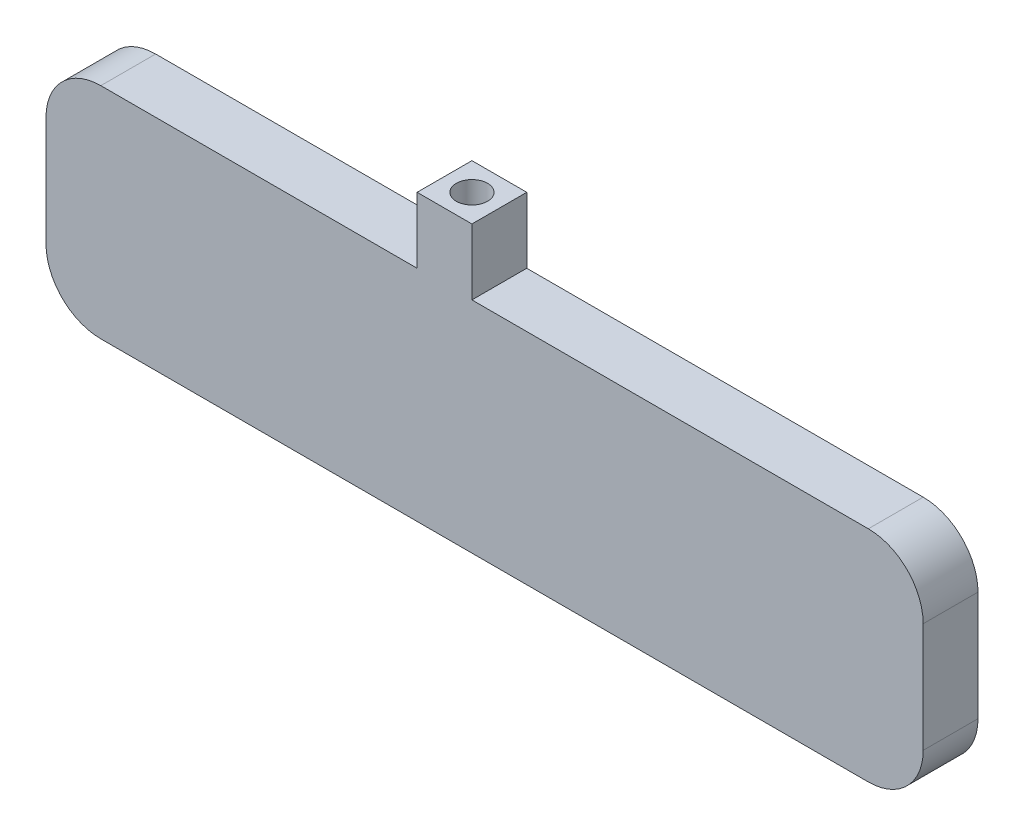
ISO-10303-21;
HEADER;
FILE_DESCRIPTION(('STEP AP214'),'2;1');
FILE_NAME('part.step','',(''),(''),'','','');
FILE_SCHEMA(('AUTOMOTIVE_DESIGN { 1 0 10303 214 1 1 1 1 }'));
ENDSEC;
DATA;
#1=APPLICATION_CONTEXT('core data for automotive mechanical design processes');
#2=APPLICATION_PROTOCOL_DEFINITION('international standard','automotive_design',2000,#1);
#3=PRODUCT_CONTEXT('',#1,'mechanical');
#4=PRODUCT('Part','Part','',(#3));
#5=PRODUCT_RELATED_PRODUCT_CATEGORY('part','',(#4));
#6=PRODUCT_DEFINITION_FORMATION('','',#4);
#7=PRODUCT_DEFINITION_CONTEXT('part definition',#1,'design');
#8=PRODUCT_DEFINITION('design','',#6,#7);
#9=PRODUCT_DEFINITION_SHAPE('','',#8);
#10=(LENGTH_UNIT() NAMED_UNIT(*) SI_UNIT(.MILLI.,.METRE.));
#11=(NAMED_UNIT(*) PLANE_ANGLE_UNIT() SI_UNIT($,.RADIAN.));
#12=(NAMED_UNIT(*) SI_UNIT($,.STERADIAN.) SOLID_ANGLE_UNIT());
#13=UNCERTAINTY_MEASURE_WITH_UNIT(LENGTH_MEASURE(1.E-05),#10,'distance_accuracy_value','');
#14=(GEOMETRIC_REPRESENTATION_CONTEXT(3) GLOBAL_UNCERTAINTY_ASSIGNED_CONTEXT((#13)) GLOBAL_UNIT_ASSIGNED_CONTEXT((#10,
#11,#12)) REPRESENTATION_CONTEXT('',''));
#15=CARTESIAN_POINT('',(0.,0.,0.));
#16=DIRECTION('',(0.,0.,1.));
#17=DIRECTION('',(1.,0.,0.));
#18=AXIS2_PLACEMENT_3D('',#15,#16,#17);
#19=CARTESIAN_POINT('',(-40.,10.,5.));
#20=DIRECTION('',(0.,-1.,0.));
#21=DIRECTION('',(0.,0.,-1.));
#22=AXIS2_PLACEMENT_3D('',#19,#20,#21);
#23=PLANE('',#22);
#24=DIRECTION('',(0.,0.,1.));
#25=VECTOR('',#24,1.);
#26=CARTESIAN_POINT('',(-6.15395389252171,10.,0.));
#27=LINE('',#26,#25);
#28=CARTESIAN_POINT('',(-6.15395389252171,10.,0.));
#29=VERTEX_POINT('',#28);
#30=CARTESIAN_POINT('',(-6.15395389252171,10.,5.));
#31=VERTEX_POINT('',#30);
#32=EDGE_CURVE('E55',#29,#31,#27,.T.);
#33=ORIENTED_EDGE('',*,*,#32,.F.);
#34=DIRECTION('',(-1.,0.,0.));
#35=VECTOR('',#34,1.);
#36=CARTESIAN_POINT('',(-40.,10.,0.));
#37=LINE('',#36,#35);
#38=CARTESIAN_POINT('',(-35.,10.,0.));
#39=VERTEX_POINT('',#38);
#40=EDGE_CURVE('E307',#29,#39,#37,.T.);
#41=ORIENTED_EDGE('',*,*,#40,.T.);
#42=DIRECTION('',(0.,0.,-1.));
#43=VECTOR('',#42,1.);
#44=CARTESIAN_POINT('',(-35.,10.,5.));
#45=LINE('',#44,#43);
#46=CARTESIAN_POINT('',(-35.,10.,5.));
#47=VERTEX_POINT('',#46);
#48=EDGE_CURVE('E357',#39,#47,#45,.F.);
#49=ORIENTED_EDGE('',*,*,#48,.T.);
#50=DIRECTION('',(-1.,0.,0.));
#51=VECTOR('',#50,1.);
#52=CARTESIAN_POINT('',(-40.,10.,5.));
#53=LINE('',#52,#51);
#54=EDGE_CURVE('E291',#31,#47,#53,.T.);
#55=ORIENTED_EDGE('',*,*,#54,.F.);
#56=EDGE_LOOP('',(#33,#41,#49,#55));
#57=FACE_BOUND('',#56,.T.);
#58=ADVANCED_FACE('F39',(#57),#23,.F.);
#59=DIRECTION('',(0.,0.,-1.));
#60=VECTOR('',#59,1.);
#61=CARTESIAN_POINT('',(-1.15395389252171,10.,0.));
#62=LINE('',#61,#60);
#63=CARTESIAN_POINT('',(-1.15395389252171,10.,5.));
#64=VERTEX_POINT('',#63);
#65=CARTESIAN_POINT('',(-1.15395389252171,10.,0.));
#66=VERTEX_POINT('',#65);
#67=EDGE_CURVE('E198',#64,#66,#62,.T.);
#68=ORIENTED_EDGE('',*,*,#67,.F.);
#69=CARTESIAN_POINT('',(35.,10.,5.));
#70=VERTEX_POINT('',#69);
#71=EDGE_CURVE('E293',#70,#64,#53,.T.);
#72=ORIENTED_EDGE('',*,*,#71,.F.);
#73=DIRECTION('',(0.,0.,-1.));
#74=VECTOR('',#73,1.);
#75=CARTESIAN_POINT('',(35.,10.,5.));
#76=LINE('',#75,#74);
#77=CARTESIAN_POINT('',(35.,10.,0.));
#78=VERTEX_POINT('',#77);
#79=EDGE_CURVE('E361',#70,#78,#76,.T.);
#80=ORIENTED_EDGE('',*,*,#79,.T.);
#81=EDGE_CURVE('E308',#78,#66,#37,.T.);
#82=ORIENTED_EDGE('',*,*,#81,.T.);
#83=EDGE_LOOP('',(#68,#72,#80,#82));
#84=FACE_BOUND('',#83,.T.);
#85=ADVANCED_FACE('F406',(#84),#23,.F.);
#86=CARTESIAN_POINT('',(0.,0.,0.));
#87=DIRECTION('',(0.,0.,1.));
#88=DIRECTION('',(1.,0.,0.));
#89=AXIS2_PLACEMENT_3D('',#86,#87,#88);
#90=PLANE('',#89);
#91=DIRECTION('',(0.,1.,0.));
#92=VECTOR('',#91,1.);
#93=CARTESIAN_POINT('',(40.,10.,0.));
#94=LINE('',#93,#92);
#95=CARTESIAN_POINT('',(40.,-5.,0.));
#96=VERTEX_POINT('',#95);
#97=CARTESIAN_POINT('',(40.,5.,0.));
#98=VERTEX_POINT('',#97);
#99=EDGE_CURVE('E261',#96,#98,#94,.T.);
#100=ORIENTED_EDGE('',*,*,#99,.F.);
#101=CARTESIAN_POINT('',(35.,-5.,0.));
#102=DIRECTION('',(0.,0.,1.));
#103=DIRECTION('',(1.,0.,0.));
#104=AXIS2_PLACEMENT_3D('',#101,#102,#103);
#105=CIRCLE('',#104,5.);
#106=CARTESIAN_POINT('',(35.,-10.,0.));
#107=VERTEX_POINT('',#106);
#108=EDGE_CURVE('E335',#96,#107,#105,.F.);
#109=ORIENTED_EDGE('',*,*,#108,.T.);
#110=DIRECTION('',(1.,0.,0.));
#111=VECTOR('',#110,1.);
#112=CARTESIAN_POINT('',(-40.,-10.,0.));
#113=LINE('',#112,#111);
#114=CARTESIAN_POINT('',(-35.,-10.,0.));
#115=VERTEX_POINT('',#114);
#116=EDGE_CURVE('E292',#115,#107,#113,.T.);
#117=ORIENTED_EDGE('',*,*,#116,.F.);
#118=CARTESIAN_POINT('',(-35.,-5.,0.));
#119=DIRECTION('',(0.,0.,1.));
#120=DIRECTION('',(1.,0.,0.));
#121=AXIS2_PLACEMENT_3D('',#118,#119,#120);
#122=CIRCLE('',#121,5.);
#123=CARTESIAN_POINT('',(-40.,-5.,0.));
#124=VERTEX_POINT('',#123);
#125=EDGE_CURVE('E329',#115,#124,#122,.F.);
#126=ORIENTED_EDGE('',*,*,#125,.T.);
#127=DIRECTION('',(0.,-1.,0.));
#128=VECTOR('',#127,1.);
#129=CARTESIAN_POINT('',(-40.,10.,0.));
#130=LINE('',#129,#128);
#131=CARTESIAN_POINT('',(-40.,5.,0.));
#132=VERTEX_POINT('',#131);
#133=EDGE_CURVE('E312',#132,#124,#130,.T.);
#134=ORIENTED_EDGE('',*,*,#133,.F.);
#135=CARTESIAN_POINT('',(-35.,5.,0.));
#136=DIRECTION('',(0.,0.,1.));
#137=DIRECTION('',(1.,0.,0.));
#138=AXIS2_PLACEMENT_3D('',#135,#136,#137);
#139=CIRCLE('',#138,5.);
#140=EDGE_CURVE('E325',#132,#39,#139,.F.);
#141=ORIENTED_EDGE('',*,*,#140,.T.);
#142=ORIENTED_EDGE('',*,*,#40,.F.);
#143=DIRECTION('',(0.,-1.,0.));
#144=VECTOR('',#143,1.);
#145=CARTESIAN_POINT('',(-6.15395389252171,16.,0.));
#146=LINE('',#145,#144);
#147=CARTESIAN_POINT('',(-6.15395389252171,16.,0.));
#148=VERTEX_POINT('',#147);
#149=EDGE_CURVE('E416',#148,#29,#146,.T.);
#150=ORIENTED_EDGE('',*,*,#149,.F.);
#151=DIRECTION('',(-1.,0.,0.));
#152=VECTOR('',#151,1.);
#153=CARTESIAN_POINT('',(-6.15395389252171,16.,0.));
#154=LINE('',#153,#152);
#155=CARTESIAN_POINT('',(-1.15395389252171,16.,0.));
#156=VERTEX_POINT('',#155);
#157=EDGE_CURVE('E195',#156,#148,#154,.T.);
#158=ORIENTED_EDGE('',*,*,#157,.F.);
#159=DIRECTION('',(0.,-1.,0.));
#160=VECTOR('',#159,1.);
#161=CARTESIAN_POINT('',(-1.15395389252171,16.,0.));
#162=LINE('',#161,#160);
#163=EDGE_CURVE('E208',#156,#66,#162,.T.);
#164=ORIENTED_EDGE('',*,*,#163,.T.);
#165=ORIENTED_EDGE('',*,*,#81,.F.);
#166=CARTESIAN_POINT('',(35.,5.,0.));
#167=DIRECTION('',(0.,0.,1.));
#168=DIRECTION('',(1.,0.,0.));
#169=AXIS2_PLACEMENT_3D('',#166,#167,#168);
#170=CIRCLE('',#169,5.);
#171=EDGE_CURVE('E332',#78,#98,#170,.F.);
#172=ORIENTED_EDGE('',*,*,#171,.T.);
#173=EDGE_LOOP('',(#100,#109,#117,#126,#134,#141,#142,#150,#158,#164,#165,#172));
#174=FACE_BOUND('',#173,.T.);
#175=CARTESIAN_POINT('',(35.,-5.,0.));
#176=DIRECTION('',(0.,0.,1.));
#177=DIRECTION('',(1.,0.,0.));
#178=AXIS2_PLACEMENT_3D('',#175,#176,#177);
#179=CIRCLE('',#178,3.);
#180=CARTESIAN_POINT('',(38.,-5.,0.));
#181=VERTEX_POINT('',#180);
#182=CARTESIAN_POINT('',(35.,-8.,0.));
#183=VERTEX_POINT('',#182);
#184=EDGE_CURVE('E265',#181,#183,#179,.F.);
#185=ORIENTED_EDGE('',*,*,#184,.F.);
#186=DIRECTION('',(0.,1.,0.));
#187=VECTOR('',#186,1.);
#188=CARTESIAN_POINT('',(38.,10.,0.));
#189=LINE('',#188,#187);
#190=CARTESIAN_POINT('',(38.,5.,0.));
#191=VERTEX_POINT('',#190);
#192=EDGE_CURVE('E202',#181,#191,#189,.T.);
#193=ORIENTED_EDGE('',*,*,#192,.T.);
#194=CARTESIAN_POINT('',(35.,5.,0.));
#195=DIRECTION('',(0.,0.,1.));
#196=DIRECTION('',(1.,0.,0.));
#197=AXIS2_PLACEMENT_3D('',#194,#195,#196);
#198=CIRCLE('',#197,3.);
#199=CARTESIAN_POINT('',(35.,8.,0.));
#200=VERTEX_POINT('',#199);
#201=EDGE_CURVE('E270',#200,#191,#198,.F.);
#202=ORIENTED_EDGE('',*,*,#201,.F.);
#203=DIRECTION('',(-1.,0.,0.));
#204=VECTOR('',#203,1.);
#205=CARTESIAN_POINT('',(-40.,8.,0.));
#206=LINE('',#205,#204);
#207=CARTESIAN_POINT('',(-35.,8.,0.));
#208=VERTEX_POINT('',#207);
#209=EDGE_CURVE('E63',#200,#208,#206,.T.);
#210=ORIENTED_EDGE('',*,*,#209,.T.);
#211=CARTESIAN_POINT('',(-35.,5.,0.));
#212=DIRECTION('',(0.,0.,1.));
#213=DIRECTION('',(1.,0.,0.));
#214=AXIS2_PLACEMENT_3D('',#211,#212,#213);
#215=CIRCLE('',#214,3.);
#216=CARTESIAN_POINT('',(-38.,5.,0.));
#217=VERTEX_POINT('',#216);
#218=EDGE_CURVE('E221',#217,#208,#215,.F.);
#219=ORIENTED_EDGE('',*,*,#218,.F.);
#220=DIRECTION('',(0.,-1.,0.));
#221=VECTOR('',#220,1.);
#222=CARTESIAN_POINT('',(-38.,10.,0.));
#223=LINE('',#222,#221);
#224=CARTESIAN_POINT('',(-38.,-5.,0.));
#225=VERTEX_POINT('',#224);
#226=EDGE_CURVE('E274',#217,#225,#223,.T.);
#227=ORIENTED_EDGE('',*,*,#226,.T.);
#228=CARTESIAN_POINT('',(-35.,-5.,0.));
#229=DIRECTION('',(0.,0.,1.));
#230=DIRECTION('',(1.,0.,0.));
#231=AXIS2_PLACEMENT_3D('',#228,#229,#230);
#232=CIRCLE('',#231,3.);
#233=CARTESIAN_POINT('',(-35.,-8.,0.));
#234=VERTEX_POINT('',#233);
#235=EDGE_CURVE('E275',#234,#225,#232,.F.);
#236=ORIENTED_EDGE('',*,*,#235,.F.);
#237=DIRECTION('',(1.,0.,0.));
#238=VECTOR('',#237,1.);
#239=CARTESIAN_POINT('',(-40.,-8.,0.));
#240=LINE('',#239,#238);
#241=EDGE_CURVE('E217',#234,#183,#240,.T.);
#242=ORIENTED_EDGE('',*,*,#241,.T.);
#243=EDGE_LOOP('',(#185,#193,#202,#210,#219,#227,#236,#242));
#244=FACE_BOUND('',#243,.T.);
#245=ADVANCED_FACE('F376',(#174,#244),#90,.F.);
#246=CARTESIAN_POINT('',(40.,10.,5.));
#247=DIRECTION('',(-1.,0.,0.));
#248=DIRECTION('',(0.,0.,1.));
#249=AXIS2_PLACEMENT_3D('',#246,#247,#248);
#250=PLANE('',#249);
#251=DIRECTION('',(0.,1.,0.));
#252=VECTOR('',#251,1.);
#253=CARTESIAN_POINT('',(40.,10.,5.));
#254=LINE('',#253,#252);
#255=CARTESIAN_POINT('',(40.,-5.,5.));
#256=VERTEX_POINT('',#255);
#257=CARTESIAN_POINT('',(40.,5.,5.));
#258=VERTEX_POINT('',#257);
#259=EDGE_CURVE('E287',#256,#258,#254,.T.);
#260=ORIENTED_EDGE('',*,*,#259,.F.);
#261=DIRECTION('',(0.,0.,-1.));
#262=VECTOR('',#261,1.);
#263=CARTESIAN_POINT('',(40.,-5.,5.));
#264=LINE('',#263,#262);
#265=EDGE_CURVE('E321',#256,#96,#264,.T.);
#266=ORIENTED_EDGE('',*,*,#265,.T.);
#267=ORIENTED_EDGE('',*,*,#99,.T.);
#268=DIRECTION('',(0.,0.,-1.));
#269=VECTOR('',#268,1.);
#270=CARTESIAN_POINT('',(40.,5.,5.));
#271=LINE('',#270,#269);
#272=EDGE_CURVE('E303',#98,#258,#271,.F.);
#273=ORIENTED_EDGE('',*,*,#272,.T.);
#274=EDGE_LOOP('',(#260,#266,#267,#273));
#275=FACE_BOUND('',#274,.T.);
#276=ADVANCED_FACE('F395',(#275),#250,.F.);
#277=CARTESIAN_POINT('',(-40.,10.,5.));
#278=DIRECTION('',(1.,0.,0.));
#279=DIRECTION('',(0.,0.,-1.));
#280=AXIS2_PLACEMENT_3D('',#277,#278,#279);
#281=PLANE('',#280);
#282=ORIENTED_EDGE('',*,*,#133,.T.);
#283=DIRECTION('',(0.,0.,-1.));
#284=VECTOR('',#283,1.);
#285=CARTESIAN_POINT('',(-40.,-5.,5.));
#286=LINE('',#285,#284);
#287=CARTESIAN_POINT('',(-40.,-5.,5.));
#288=VERTEX_POINT('',#287);
#289=EDGE_CURVE('E11',#124,#288,#286,.F.);
#290=ORIENTED_EDGE('',*,*,#289,.T.);
#291=DIRECTION('',(0.,-1.,0.));
#292=VECTOR('',#291,1.);
#293=CARTESIAN_POINT('',(-40.,10.,5.));
#294=LINE('',#293,#292);
#295=CARTESIAN_POINT('',(-40.,5.,5.));
#296=VERTEX_POINT('',#295);
#297=EDGE_CURVE('E296',#296,#288,#294,.T.);
#298=ORIENTED_EDGE('',*,*,#297,.F.);
#299=DIRECTION('',(0.,0.,-1.));
#300=VECTOR('',#299,1.);
#301=CARTESIAN_POINT('',(-40.,5.,5.));
#302=LINE('',#301,#300);
#303=EDGE_CURVE('E48',#296,#132,#302,.T.);
#304=ORIENTED_EDGE('',*,*,#303,.T.);
#305=EDGE_LOOP('',(#282,#290,#298,#304));
#306=FACE_BOUND('',#305,.T.);
#307=ADVANCED_FACE('F370',(#306),#281,.F.);
#308=CARTESIAN_POINT('',(-40.,-10.,5.));
#309=DIRECTION('',(0.,1.,0.));
#310=DIRECTION('',(0.,0.,1.));
#311=AXIS2_PLACEMENT_3D('',#308,#309,#310);
#312=PLANE('',#311);
#313=ORIENTED_EDGE('',*,*,#116,.T.);
#314=DIRECTION('',(0.,0.,-1.));
#315=VECTOR('',#314,1.);
#316=CARTESIAN_POINT('',(35.,-10.,5.));
#317=LINE('',#316,#315);
#318=CARTESIAN_POINT('',(35.,-10.,5.));
#319=VERTEX_POINT('',#318);
#320=EDGE_CURVE('E342',#107,#319,#317,.F.);
#321=ORIENTED_EDGE('',*,*,#320,.T.);
#322=DIRECTION('',(1.,0.,0.));
#323=VECTOR('',#322,1.);
#324=CARTESIAN_POINT('',(-40.,-10.,5.));
#325=LINE('',#324,#323);
#326=CARTESIAN_POINT('',(-35.,-10.,5.));
#327=VERTEX_POINT('',#326);
#328=EDGE_CURVE('E300',#327,#319,#325,.T.);
#329=ORIENTED_EDGE('',*,*,#328,.F.);
#330=DIRECTION('',(0.,0.,-1.));
#331=VECTOR('',#330,1.);
#332=CARTESIAN_POINT('',(-35.,-10.,5.));
#333=LINE('',#332,#331);
#334=EDGE_CURVE('E338',#327,#115,#333,.T.);
#335=ORIENTED_EDGE('',*,*,#334,.T.);
#336=EDGE_LOOP('',(#313,#321,#329,#335));
#337=FACE_BOUND('',#336,.T.);
#338=ADVANCED_FACE('F387',(#337),#312,.F.);
#339=CARTESIAN_POINT('',(0.,0.,5.));
#340=DIRECTION('',(0.,0.,1.));
#341=DIRECTION('',(1.,0.,0.));
#342=AXIS2_PLACEMENT_3D('',#339,#340,#341);
#343=PLANE('',#342);
#344=ORIENTED_EDGE('',*,*,#328,.T.);
#345=CARTESIAN_POINT('',(35.,-5.,5.));
#346=DIRECTION('',(0.,0.,1.));
#347=DIRECTION('',(1.,0.,0.));
#348=AXIS2_PLACEMENT_3D('',#345,#346,#347);
#349=CIRCLE('',#348,5.);
#350=EDGE_CURVE('E354',#319,#256,#349,.T.);
#351=ORIENTED_EDGE('',*,*,#350,.T.);
#352=ORIENTED_EDGE('',*,*,#259,.T.);
#353=CARTESIAN_POINT('',(35.,5.,5.));
#354=DIRECTION('',(0.,0.,1.));
#355=DIRECTION('',(1.,0.,0.));
#356=AXIS2_PLACEMENT_3D('',#353,#354,#355);
#357=CIRCLE('',#356,5.);
#358=EDGE_CURVE('E351',#258,#70,#357,.T.);
#359=ORIENTED_EDGE('',*,*,#358,.T.);
#360=ORIENTED_EDGE('',*,*,#71,.T.);
#361=DIRECTION('',(0.,-1.,0.));
#362=VECTOR('',#361,1.);
#363=CARTESIAN_POINT('',(-1.15395389252171,16.,5.));
#364=LINE('',#363,#362);
#365=CARTESIAN_POINT('',(-1.15395389252171,16.,5.));
#366=VERTEX_POINT('',#365);
#367=EDGE_CURVE('E185',#366,#64,#364,.T.);
#368=ORIENTED_EDGE('',*,*,#367,.F.);
#369=DIRECTION('',(1.,0.,0.));
#370=VECTOR('',#369,1.);
#371=CARTESIAN_POINT('',(-6.15395389252171,16.,5.));
#372=LINE('',#371,#370);
#373=CARTESIAN_POINT('',(-6.15395389252171,16.,5.));
#374=VERTEX_POINT('',#373);
#375=EDGE_CURVE('E178',#374,#366,#372,.T.);
#376=ORIENTED_EDGE('',*,*,#375,.F.);
#377=DIRECTION('',(0.,-1.,0.));
#378=VECTOR('',#377,1.);
#379=CARTESIAN_POINT('',(-6.15395389252171,16.,5.));
#380=LINE('',#379,#378);
#381=EDGE_CURVE('E182',#374,#31,#380,.T.);
#382=ORIENTED_EDGE('',*,*,#381,.T.);
#383=ORIENTED_EDGE('',*,*,#54,.T.);
#384=CARTESIAN_POINT('',(-35.,5.,5.));
#385=DIRECTION('',(0.,0.,1.));
#386=DIRECTION('',(1.,0.,0.));
#387=AXIS2_PLACEMENT_3D('',#384,#385,#386);
#388=CIRCLE('',#387,5.);
#389=EDGE_CURVE('E345',#47,#296,#388,.T.);
#390=ORIENTED_EDGE('',*,*,#389,.T.);
#391=ORIENTED_EDGE('',*,*,#297,.T.);
#392=CARTESIAN_POINT('',(-35.,-5.,5.));
#393=DIRECTION('',(0.,0.,1.));
#394=DIRECTION('',(1.,0.,0.));
#395=AXIS2_PLACEMENT_3D('',#392,#393,#394);
#396=CIRCLE('',#395,5.);
#397=EDGE_CURVE('E348',#288,#327,#396,.T.);
#398=ORIENTED_EDGE('',*,*,#397,.T.);
#399=EDGE_LOOP('',(#344,#351,#352,#359,#360,#368,#376,#382,#383,#390,#391,#398));
#400=FACE_BOUND('',#399,.T.);
#401=ADVANCED_FACE('F181',(#400),#343,.T.);
#402=CARTESIAN_POINT('',(35.,-5.,5.));
#403=DIRECTION('',(0.,0.,-1.));
#404=DIRECTION('',(-1.,0.,0.));
#405=AXIS2_PLACEMENT_3D('',#402,#403,#404);
#406=CYLINDRICAL_SURFACE('',#405,5.);
#407=ORIENTED_EDGE('',*,*,#350,.F.);
#408=ORIENTED_EDGE('',*,*,#320,.F.);
#409=ORIENTED_EDGE('',*,*,#108,.F.);
#410=ORIENTED_EDGE('',*,*,#265,.F.);
#411=EDGE_LOOP('',(#407,#408,#409,#410));
#412=FACE_BOUND('',#411,.T.);
#413=ADVANCED_FACE('F393',(#412),#406,.T.);
#414=CARTESIAN_POINT('',(35.,5.,5.));
#415=DIRECTION('',(0.,0.,-1.));
#416=DIRECTION('',(-1.,0.,0.));
#417=AXIS2_PLACEMENT_3D('',#414,#415,#416);
#418=CYLINDRICAL_SURFACE('',#417,5.);
#419=ORIENTED_EDGE('',*,*,#358,.F.);
#420=ORIENTED_EDGE('',*,*,#272,.F.);
#421=ORIENTED_EDGE('',*,*,#171,.F.);
#422=ORIENTED_EDGE('',*,*,#79,.F.);
#423=EDGE_LOOP('',(#419,#420,#421,#422));
#424=FACE_BOUND('',#423,.T.);
#425=ADVANCED_FACE('F402',(#424),#418,.T.);
#426=CARTESIAN_POINT('',(-35.,-5.,5.));
#427=DIRECTION('',(0.,0.,-1.));
#428=DIRECTION('',(-1.,0.,0.));
#429=AXIS2_PLACEMENT_3D('',#426,#427,#428);
#430=CYLINDRICAL_SURFACE('',#429,5.);
#431=ORIENTED_EDGE('',*,*,#397,.F.);
#432=ORIENTED_EDGE('',*,*,#289,.F.);
#433=ORIENTED_EDGE('',*,*,#125,.F.);
#434=ORIENTED_EDGE('',*,*,#334,.F.);
#435=EDGE_LOOP('',(#431,#432,#433,#434));
#436=FACE_BOUND('',#435,.T.);
#437=ADVANCED_FACE('F384',(#436),#430,.T.);
#438=CARTESIAN_POINT('',(-35.,5.,5.));
#439=DIRECTION('',(0.,0.,-1.));
#440=DIRECTION('',(-1.,0.,0.));
#441=AXIS2_PLACEMENT_3D('',#438,#439,#440);
#442=CYLINDRICAL_SURFACE('',#441,5.);
#443=ORIENTED_EDGE('',*,*,#389,.F.);
#444=ORIENTED_EDGE('',*,*,#48,.F.);
#445=ORIENTED_EDGE('',*,*,#140,.F.);
#446=ORIENTED_EDGE('',*,*,#303,.F.);
#447=EDGE_LOOP('',(#443,#444,#445,#446));
#448=FACE_BOUND('',#447,.T.);
#449=ADVANCED_FACE('F41',(#448),#442,.T.);
#450=CARTESIAN_POINT('',(38.,10.,5.));
#451=DIRECTION('',(-1.,0.,0.));
#452=DIRECTION('',(0.,0.,1.));
#453=AXIS2_PLACEMENT_3D('',#450,#451,#452);
#454=PLANE('',#453);
#455=DIRECTION('',(0.,1.,0.));
#456=VECTOR('',#455,1.);
#457=CARTESIAN_POINT('',(38.,10.,3.));
#458=LINE('',#457,#456);
#459=CARTESIAN_POINT('',(38.,-5.,3.));
#460=VERTEX_POINT('',#459);
#461=CARTESIAN_POINT('',(38.,5.,3.));
#462=VERTEX_POINT('',#461);
#463=EDGE_CURVE('E212',#460,#462,#458,.T.);
#464=ORIENTED_EDGE('',*,*,#463,.T.);
#465=DIRECTION('',(0.,0.,1.));
#466=VECTOR('',#465,1.);
#467=CARTESIAN_POINT('',(38.,5.,5.));
#468=LINE('',#467,#466);
#469=EDGE_CURVE('E222',#191,#462,#468,.T.);
#470=ORIENTED_EDGE('',*,*,#469,.F.);
#471=ORIENTED_EDGE('',*,*,#192,.F.);
#472=DIRECTION('',(0.,0.,1.));
#473=VECTOR('',#472,1.);
#474=CARTESIAN_POINT('',(38.,-5.,5.));
#475=LINE('',#474,#473);
#476=EDGE_CURVE('E218',#460,#181,#475,.F.);
#477=ORIENTED_EDGE('',*,*,#476,.F.);
#478=EDGE_LOOP('',(#464,#470,#471,#477));
#479=FACE_BOUND('',#478,.T.);
#480=ADVANCED_FACE('F464',(#479),#454,.T.);
#481=CARTESIAN_POINT('',(-40.,8.,5.));
#482=DIRECTION('',(0.,-1.,0.));
#483=DIRECTION('',(0.,0.,-1.));
#484=AXIS2_PLACEMENT_3D('',#481,#482,#483);
#485=PLANE('',#484);
#486=DIRECTION('',(-1.,0.,0.));
#487=VECTOR('',#486,1.);
#488=CARTESIAN_POINT('',(-40.,8.,3.));
#489=LINE('',#488,#487);
#490=CARTESIAN_POINT('',(35.,8.,3.));
#491=VERTEX_POINT('',#490);
#492=CARTESIAN_POINT('',(-35.,8.,3.));
#493=VERTEX_POINT('',#492);
#494=EDGE_CURVE('E216',#491,#493,#489,.T.);
#495=ORIENTED_EDGE('',*,*,#494,.T.);
#496=DIRECTION('',(0.,0.,-1.));
#497=VECTOR('',#496,1.);
#498=CARTESIAN_POINT('',(-35.,8.,5.));
#499=LINE('',#498,#497);
#500=EDGE_CURVE('E233',#208,#493,#499,.F.);
#501=ORIENTED_EDGE('',*,*,#500,.F.);
#502=ORIENTED_EDGE('',*,*,#209,.F.);
#503=DIRECTION('',(0.,0.,-1.));
#504=VECTOR('',#503,1.);
#505=CARTESIAN_POINT('',(35.,8.,5.));
#506=LINE('',#505,#504);
#507=EDGE_CURVE('E250',#491,#200,#506,.T.);
#508=ORIENTED_EDGE('',*,*,#507,.F.);
#509=EDGE_LOOP('',(#495,#501,#502,#508));
#510=FACE_BOUND('',#509,.T.);
#511=ADVANCED_FACE('F468',(#510),#485,.T.);
#512=CARTESIAN_POINT('',(-38.,10.,5.));
#513=DIRECTION('',(1.,0.,0.));
#514=DIRECTION('',(0.,0.,-1.));
#515=AXIS2_PLACEMENT_3D('',#512,#513,#514);
#516=PLANE('',#515);
#517=ORIENTED_EDGE('',*,*,#226,.F.);
#518=DIRECTION('',(0.,0.,-1.));
#519=VECTOR('',#518,1.);
#520=CARTESIAN_POINT('',(-38.,5.,5.));
#521=LINE('',#520,#519);
#522=CARTESIAN_POINT('',(-38.,5.,3.));
#523=VERTEX_POINT('',#522);
#524=EDGE_CURVE('E253',#523,#217,#521,.T.);
#525=ORIENTED_EDGE('',*,*,#524,.F.);
#526=DIRECTION('',(0.,-1.,0.));
#527=VECTOR('',#526,1.);
#528=CARTESIAN_POINT('',(-38.,10.,3.));
#529=LINE('',#528,#527);
#530=CARTESIAN_POINT('',(-38.,-5.,3.));
#531=VERTEX_POINT('',#530);
#532=EDGE_CURVE('E229',#523,#531,#529,.T.);
#533=ORIENTED_EDGE('',*,*,#532,.T.);
#534=DIRECTION('',(0.,0.,-1.));
#535=VECTOR('',#534,1.);
#536=CARTESIAN_POINT('',(-38.,-5.,5.));
#537=LINE('',#536,#535);
#538=EDGE_CURVE('E258',#225,#531,#537,.F.);
#539=ORIENTED_EDGE('',*,*,#538,.F.);
#540=EDGE_LOOP('',(#517,#525,#533,#539));
#541=FACE_BOUND('',#540,.T.);
#542=ADVANCED_FACE('F476',(#541),#516,.T.);
#543=CARTESIAN_POINT('',(-40.,-8.,5.));
#544=DIRECTION('',(0.,1.,0.));
#545=DIRECTION('',(0.,0.,1.));
#546=AXIS2_PLACEMENT_3D('',#543,#544,#545);
#547=PLANE('',#546);
#548=ORIENTED_EDGE('',*,*,#241,.F.);
#549=DIRECTION('',(0.,0.,1.));
#550=VECTOR('',#549,1.);
#551=CARTESIAN_POINT('',(-35.,-8.,5.));
#552=LINE('',#551,#550);
#553=CARTESIAN_POINT('',(-35.,-8.,3.));
#554=VERTEX_POINT('',#553);
#555=EDGE_CURVE('E262',#554,#234,#552,.F.);
#556=ORIENTED_EDGE('',*,*,#555,.F.);
#557=DIRECTION('',(1.,0.,0.));
#558=VECTOR('',#557,1.);
#559=CARTESIAN_POINT('',(-40.,-8.,3.));
#560=LINE('',#559,#558);
#561=CARTESIAN_POINT('',(35.,-8.,3.));
#562=VERTEX_POINT('',#561);
#563=EDGE_CURVE('E225',#554,#562,#560,.T.);
#564=ORIENTED_EDGE('',*,*,#563,.T.);
#565=DIRECTION('',(0.,0.,1.));
#566=VECTOR('',#565,1.);
#567=CARTESIAN_POINT('',(35.,-8.,5.));
#568=LINE('',#567,#566);
#569=EDGE_CURVE('E244',#183,#562,#568,.T.);
#570=ORIENTED_EDGE('',*,*,#569,.F.);
#571=EDGE_LOOP('',(#548,#556,#564,#570));
#572=FACE_BOUND('',#571,.T.);
#573=ADVANCED_FACE('F482',(#572),#547,.T.);
#574=CARTESIAN_POINT('',(0.,0.,3.));
#575=DIRECTION('',(0.,0.,1.));
#576=DIRECTION('',(1.,0.,0.));
#577=AXIS2_PLACEMENT_3D('',#574,#575,#576);
#578=PLANE('',#577);
#579=ORIENTED_EDGE('',*,*,#563,.F.);
#580=CARTESIAN_POINT('',(-35.,-5.,3.));
#581=DIRECTION('',(0.,0.,1.));
#582=DIRECTION('',(1.,0.,0.));
#583=AXIS2_PLACEMENT_3D('',#580,#581,#582);
#584=CIRCLE('',#583,3.);
#585=EDGE_CURVE('E237',#531,#554,#584,.T.);
#586=ORIENTED_EDGE('',*,*,#585,.F.);
#587=ORIENTED_EDGE('',*,*,#532,.F.);
#588=CARTESIAN_POINT('',(-35.,5.,3.));
#589=DIRECTION('',(0.,0.,1.));
#590=DIRECTION('',(1.,0.,0.));
#591=AXIS2_PLACEMENT_3D('',#588,#589,#590);
#592=CIRCLE('',#591,3.);
#593=EDGE_CURVE('E241',#493,#523,#592,.T.);
#594=ORIENTED_EDGE('',*,*,#593,.F.);
#595=ORIENTED_EDGE('',*,*,#494,.F.);
#596=CARTESIAN_POINT('',(35.,5.,3.));
#597=DIRECTION('',(0.,0.,1.));
#598=DIRECTION('',(1.,0.,0.));
#599=AXIS2_PLACEMENT_3D('',#596,#597,#598);
#600=CIRCLE('',#599,3.);
#601=EDGE_CURVE('E234',#462,#491,#600,.T.);
#602=ORIENTED_EDGE('',*,*,#601,.F.);
#603=ORIENTED_EDGE('',*,*,#463,.F.);
#604=CARTESIAN_POINT('',(35.,-5.,3.));
#605=DIRECTION('',(0.,0.,1.));
#606=DIRECTION('',(1.,0.,0.));
#607=AXIS2_PLACEMENT_3D('',#604,#605,#606);
#608=CIRCLE('',#607,3.);
#609=EDGE_CURVE('E230',#562,#460,#608,.T.);
#610=ORIENTED_EDGE('',*,*,#609,.F.);
#611=EDGE_LOOP('',(#579,#586,#587,#594,#595,#602,#603,#610));
#612=FACE_BOUND('',#611,.T.);
#613=ADVANCED_FACE('F486',(#612),#578,.F.);
#614=CARTESIAN_POINT('',(35.,-5.,5.));
#615=DIRECTION('',(0.,0.,-1.));
#616=DIRECTION('',(-1.,0.,0.));
#617=AXIS2_PLACEMENT_3D('',#614,#615,#616);
#618=CYLINDRICAL_SURFACE('',#617,3.);
#619=ORIENTED_EDGE('',*,*,#609,.T.);
#620=ORIENTED_EDGE('',*,*,#476,.T.);
#621=ORIENTED_EDGE('',*,*,#184,.T.);
#622=ORIENTED_EDGE('',*,*,#569,.T.);
#623=EDGE_LOOP('',(#619,#620,#621,#622));
#624=FACE_BOUND('',#623,.T.);
#625=ADVANCED_FACE('F490',(#624),#618,.F.);
#626=CARTESIAN_POINT('',(35.,5.,5.));
#627=DIRECTION('',(0.,0.,-1.));
#628=DIRECTION('',(-1.,0.,0.));
#629=AXIS2_PLACEMENT_3D('',#626,#627,#628);
#630=CYLINDRICAL_SURFACE('',#629,3.);
#631=ORIENTED_EDGE('',*,*,#601,.T.);
#632=ORIENTED_EDGE('',*,*,#507,.T.);
#633=ORIENTED_EDGE('',*,*,#201,.T.);
#634=ORIENTED_EDGE('',*,*,#469,.T.);
#635=EDGE_LOOP('',(#631,#632,#633,#634));
#636=FACE_BOUND('',#635,.T.);
#637=ADVANCED_FACE('F494',(#636),#630,.F.);
#638=CARTESIAN_POINT('',(-35.,-5.,5.));
#639=DIRECTION('',(0.,0.,-1.));
#640=DIRECTION('',(-1.,0.,0.));
#641=AXIS2_PLACEMENT_3D('',#638,#639,#640);
#642=CYLINDRICAL_SURFACE('',#641,3.);
#643=ORIENTED_EDGE('',*,*,#585,.T.);
#644=ORIENTED_EDGE('',*,*,#555,.T.);
#645=ORIENTED_EDGE('',*,*,#235,.T.);
#646=ORIENTED_EDGE('',*,*,#538,.T.);
#647=EDGE_LOOP('',(#643,#644,#645,#646));
#648=FACE_BOUND('',#647,.T.);
#649=ADVANCED_FACE('F498',(#648),#642,.F.);
#650=CARTESIAN_POINT('',(-35.,5.,5.));
#651=DIRECTION('',(0.,0.,-1.));
#652=DIRECTION('',(-1.,0.,0.));
#653=AXIS2_PLACEMENT_3D('',#650,#651,#652);
#654=CYLINDRICAL_SURFACE('',#653,3.);
#655=ORIENTED_EDGE('',*,*,#593,.T.);
#656=ORIENTED_EDGE('',*,*,#524,.T.);
#657=ORIENTED_EDGE('',*,*,#218,.T.);
#658=ORIENTED_EDGE('',*,*,#500,.T.);
#659=EDGE_LOOP('',(#655,#656,#657,#658));
#660=FACE_BOUND('',#659,.T.);
#661=ADVANCED_FACE('F502',(#660),#654,.F.);
#662=CARTESIAN_POINT('',(-6.15395389252171,16.,0.));
#663=DIRECTION('',(1.,0.,0.));
#664=DIRECTION('',(0.,0.,-1.));
#665=AXIS2_PLACEMENT_3D('',#662,#663,#664);
#666=PLANE('',#665);
#667=ORIENTED_EDGE('',*,*,#32,.T.);
#668=ORIENTED_EDGE('',*,*,#381,.F.);
#669=DIRECTION('',(0.,0.,1.));
#670=VECTOR('',#669,1.);
#671=CARTESIAN_POINT('',(-6.15395389252171,16.,0.));
#672=LINE('',#671,#670);
#673=EDGE_CURVE('E190',#148,#374,#672,.T.);
#674=ORIENTED_EDGE('',*,*,#673,.F.);
#675=ORIENTED_EDGE('',*,*,#149,.T.);
#676=EDGE_LOOP('',(#667,#668,#674,#675));
#677=FACE_BOUND('',#676,.T.);
#678=ADVANCED_FACE('F200',(#677),#666,.F.);
#679=CARTESIAN_POINT('',(-1.15395389252171,16.,0.));
#680=DIRECTION('',(-1.,0.,0.));
#681=DIRECTION('',(0.,0.,1.));
#682=AXIS2_PLACEMENT_3D('',#679,#680,#681);
#683=PLANE('',#682);
#684=ORIENTED_EDGE('',*,*,#67,.T.);
#685=ORIENTED_EDGE('',*,*,#163,.F.);
#686=DIRECTION('',(0.,0.,-1.));
#687=VECTOR('',#686,1.);
#688=CARTESIAN_POINT('',(-1.15395389252171,16.,0.));
#689=LINE('',#688,#687);
#690=EDGE_CURVE('E189',#366,#156,#689,.T.);
#691=ORIENTED_EDGE('',*,*,#690,.F.);
#692=ORIENTED_EDGE('',*,*,#367,.T.);
#693=EDGE_LOOP('',(#684,#685,#691,#692));
#694=FACE_BOUND('',#693,.T.);
#695=ADVANCED_FACE('F419',(#694),#683,.F.);
#696=CARTESIAN_POINT('',(0.,16.,0.));
#697=DIRECTION('',(0.,1.,0.));
#698=DIRECTION('',(0.,0.,1.));
#699=AXIS2_PLACEMENT_3D('',#696,#697,#698);
#700=PLANE('',#699);
#701=CARTESIAN_POINT('',(-3.65395389252171,16.,2.5));
#702=DIRECTION('',(0.,1.,0.));
#703=DIRECTION('',(0.,0.,1.));
#704=AXIS2_PLACEMENT_3D('',#701,#702,#703);
#705=CIRCLE('',#704,1.425);
#706=CARTESIAN_POINT('',(-3.65395389252171,16.,3.925));
#707=VERTEX_POINT('',#706);
#708=EDGE_CURVE('E424',#707,#707,#705,.T.);
#709=ORIENTED_EDGE('',*,*,#708,.F.);
#710=EDGE_LOOP('',(#709));
#711=FACE_BOUND('',#710,.T.);
#712=ORIENTED_EDGE('',*,*,#673,.T.);
#713=ORIENTED_EDGE('',*,*,#375,.T.);
#714=ORIENTED_EDGE('',*,*,#690,.T.);
#715=ORIENTED_EDGE('',*,*,#157,.T.);
#716=EDGE_LOOP('',(#712,#713,#714,#715));
#717=FACE_BOUND('',#716,.T.);
#718=ADVANCED_FACE('F193',(#711,#717),#700,.T.);
#719=CARTESIAN_POINT('',(-3.65395389252171,12.,2.5));
#720=DIRECTION('',(0.,1.,0.));
#721=DIRECTION('',(0.,0.,1.));
#722=AXIS2_PLACEMENT_3D('',#719,#720,#721);
#723=CYLINDRICAL_SURFACE('',#722,1.425);
#724=CARTESIAN_POINT('',(-3.65395389252171,12.,2.5));
#725=DIRECTION('',(0.,1.,0.));
#726=DIRECTION('',(0.,0.,1.));
#727=AXIS2_PLACEMENT_3D('',#724,#725,#726);
#728=CIRCLE('',#727,1.425);
#729=CARTESIAN_POINT('',(-3.65395389252171,12.,3.925));
#730=VERTEX_POINT('',#729);
#731=EDGE_CURVE('E412',#730,#730,#728,.T.);
#732=ORIENTED_EDGE('',*,*,#731,.F.);
#733=EDGE_LOOP('',(#732));
#734=FACE_BOUND('',#733,.T.);
#735=ORIENTED_EDGE('',*,*,#708,.T.);
#736=EDGE_LOOP('',(#735));
#737=FACE_BOUND('',#736,.T.);
#738=ADVANCED_FACE('F434',(#734,#737),#723,.F.);
#739=CARTESIAN_POINT('',(-3.65395389252171,12.,2.5));
#740=DIRECTION('',(0.,1.,0.));
#741=DIRECTION('',(0.,0.,1.));
#742=AXIS2_PLACEMENT_3D('',#739,#740,#741);
#743=PLANE('',#742);
#744=ORIENTED_EDGE('',*,*,#731,.T.);
#745=EDGE_LOOP('',(#744));
#746=FACE_BOUND('',#745,.T.);
#747=ADVANCED_FACE('F432',(#746),#743,.T.);
#748=CLOSED_SHELL('',(#58,#85,#245,#276,#307,#338,#401,#413,#425,#437,#449,#480,#511,#542,#573,
#613,#625,#637,#649,#661,#678,#695,#718,#738,#747));
#749=MANIFOLD_SOLID_BREP('B2',#748);
#750=ADVANCED_BREP_SHAPE_REPRESENTATION('',(#18,#749),#14);
#751=SHAPE_DEFINITION_REPRESENTATION(#9,#750);
ENDSEC;
END-ISO-10303-21;
